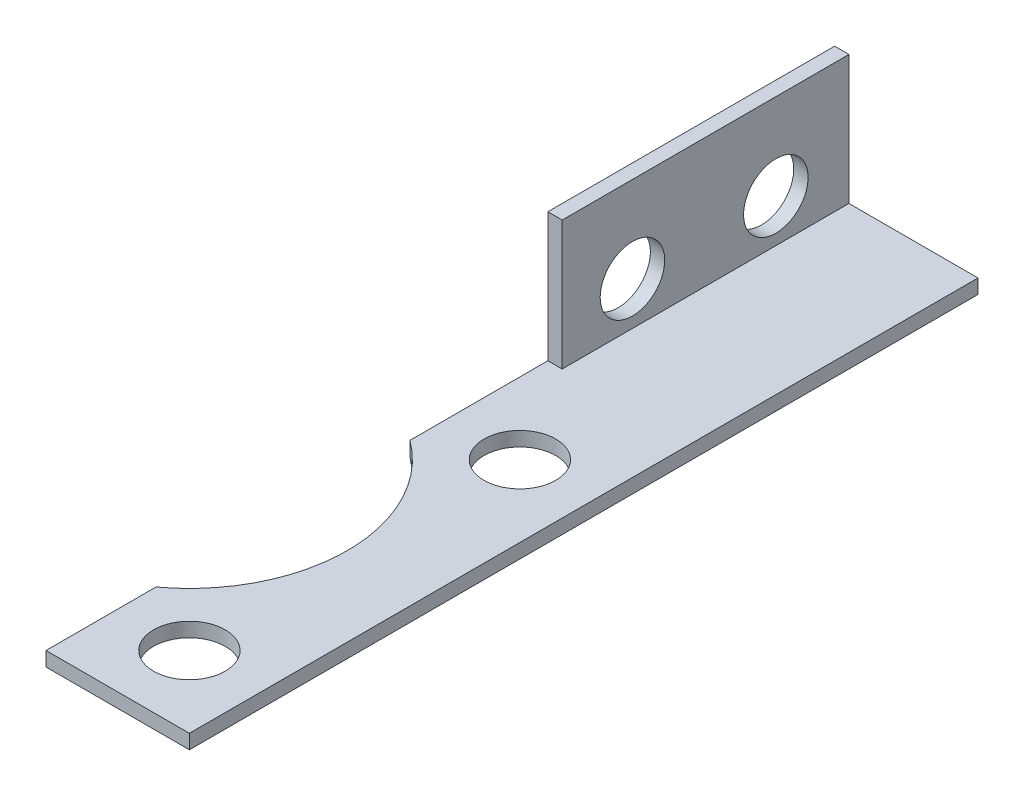
ISO-10303-21;
HEADER;
FILE_DESCRIPTION(('STEP AP214'),'2;1');
FILE_NAME('part.step','',(''),(''),'','','');
FILE_SCHEMA(('AUTOMOTIVE_DESIGN { 1 0 10303 214 1 1 1 1 }'));
ENDSEC;
DATA;
#1=APPLICATION_CONTEXT('core data for automotive mechanical design processes');
#2=APPLICATION_PROTOCOL_DEFINITION('international standard','automotive_design',2000,#1);
#3=PRODUCT_CONTEXT('',#1,'mechanical');
#4=PRODUCT('Part','Part','',(#3));
#5=PRODUCT_RELATED_PRODUCT_CATEGORY('part','',(#4));
#6=PRODUCT_DEFINITION_FORMATION('','',#4);
#7=PRODUCT_DEFINITION_CONTEXT('part definition',#1,'design');
#8=PRODUCT_DEFINITION('design','',#6,#7);
#9=PRODUCT_DEFINITION_SHAPE('','',#8);
#10=(LENGTH_UNIT() NAMED_UNIT(*) SI_UNIT(.MILLI.,.METRE.));
#11=(NAMED_UNIT(*) PLANE_ANGLE_UNIT() SI_UNIT($,.RADIAN.));
#12=(NAMED_UNIT(*) SI_UNIT($,.STERADIAN.) SOLID_ANGLE_UNIT());
#13=UNCERTAINTY_MEASURE_WITH_UNIT(LENGTH_MEASURE(1.E-05),#10,'distance_accuracy_value','');
#14=(GEOMETRIC_REPRESENTATION_CONTEXT(3) GLOBAL_UNCERTAINTY_ASSIGNED_CONTEXT((#13)) GLOBAL_UNIT_ASSIGNED_CONTEXT((#10,
#11,#12)) REPRESENTATION_CONTEXT('',''));
#15=CARTESIAN_POINT('',(0.,0.,0.));
#16=DIRECTION('',(0.,0.,1.));
#17=DIRECTION('',(1.,0.,0.));
#18=AXIS2_PLACEMENT_3D('',#15,#16,#17);
#19=CARTESIAN_POINT('',(1.,10.,55.));
#20=DIRECTION('',(0.,-1.,0.));
#21=DIRECTION('',(0.,0.,-1.));
#22=AXIS2_PLACEMENT_3D('',#19,#20,#21);
#23=PLANE('',#22);
#24=DIRECTION('',(-1.,0.,0.));
#25=VECTOR('',#24,1.);
#26=CARTESIAN_POINT('',(0.,10.,20.));
#27=LINE('',#26,#25);
#28=CARTESIAN_POINT('',(0.999999999999999,10.,20.));
#29=VERTEX_POINT('',#28);
#30=CARTESIAN_POINT('',(0.,10.,20.));
#31=VERTEX_POINT('',#30);
#32=EDGE_CURVE('E130',#29,#31,#27,.T.);
#33=ORIENTED_EDGE('',*,*,#32,.F.);
#34=DIRECTION('',(0.,0.,-1.));
#35=VECTOR('',#34,1.);
#36=CARTESIAN_POINT('',(1.,10.,55.));
#37=LINE('',#36,#35);
#38=CARTESIAN_POINT('',(1.,10.,0.));
#39=VERTEX_POINT('',#38);
#40=EDGE_CURVE('E87',#29,#39,#37,.T.);
#41=ORIENTED_EDGE('',*,*,#40,.T.);
#42=DIRECTION('',(-1.,0.,0.));
#43=VECTOR('',#42,1.);
#44=CARTESIAN_POINT('',(1.,10.,0.));
#45=LINE('',#44,#43);
#46=CARTESIAN_POINT('',(0.,10.,0.));
#47=VERTEX_POINT('',#46);
#48=EDGE_CURVE('E163',#39,#47,#45,.T.);
#49=ORIENTED_EDGE('',*,*,#48,.T.);
#50=DIRECTION('',(0.,0.,-1.));
#51=VECTOR('',#50,1.);
#52=CARTESIAN_POINT('',(0.,10.,55.));
#53=LINE('',#52,#51);
#54=EDGE_CURVE('E11',#31,#47,#53,.T.);
#55=ORIENTED_EDGE('',*,*,#54,.F.);
#56=EDGE_LOOP('',(#33,#41,#49,#55));
#57=FACE_BOUND('',#56,.T.);
#58=ADVANCED_FACE('F38',(#57),#23,.F.);
#59=CARTESIAN_POINT('',(0.,10.,55.));
#60=DIRECTION('',(1.,0.,0.));
#61=DIRECTION('',(0.,0.,-1.));
#62=AXIS2_PLACEMENT_3D('',#59,#60,#61);
#63=PLANE('',#62);
#64=DIRECTION('',(0.,-1.,0.));
#65=VECTOR('',#64,1.);
#66=CARTESIAN_POINT('',(0.,10.,55.));
#67=LINE('',#66,#65);
#68=CARTESIAN_POINT('',(0.,0.999999999999999,55.));
#69=VERTEX_POINT('',#68);
#70=CARTESIAN_POINT('',(0.,0.,55.));
#71=VERTEX_POINT('',#70);
#72=EDGE_CURVE('E91',#69,#71,#67,.T.);
#73=ORIENTED_EDGE('',*,*,#72,.F.);
#74=DIRECTION('',(0.,0.,1.));
#75=VECTOR('',#74,1.);
#76=CARTESIAN_POINT('',(0.,0.999999999999999,20.));
#77=LINE('',#76,#75);
#78=CARTESIAN_POINT('',(0.,0.999999999999999,47.3307537793234));
#79=VERTEX_POINT('',#78);
#80=EDGE_CURVE('E138',#79,#69,#77,.T.);
#81=ORIENTED_EDGE('',*,*,#80,.F.);
#82=DIRECTION('',(0.,1.,0.));
#83=VECTOR('',#82,1.);
#84=CARTESIAN_POINT('',(0.,0.,47.3307537793234));
#85=LINE('',#84,#83);
#86=CARTESIAN_POINT('',(0.,0.,47.3307537793234));
#87=VERTEX_POINT('',#86);
#88=EDGE_CURVE('E157',#79,#87,#85,.F.);
#89=ORIENTED_EDGE('',*,*,#88,.T.);
#90=DIRECTION('',(0.,0.,-1.));
#91=VECTOR('',#90,1.);
#92=CARTESIAN_POINT('',(0.,0.,55.));
#93=LINE('',#92,#91);
#94=EDGE_CURVE('E45',#71,#87,#93,.T.);
#95=ORIENTED_EDGE('',*,*,#94,.F.);
#96=EDGE_LOOP('',(#73,#81,#89,#95));
#97=FACE_BOUND('',#96,.T.);
#98=ADVANCED_FACE('F220',(#97),#63,.F.);
#99=CARTESIAN_POINT('',(0.999999999999999,0.999999999999999,55.));
#100=DIRECTION('',(-1.,0.,0.));
#101=DIRECTION('',(0.,-1.,0.));
#102=AXIS2_PLACEMENT_3D('',#99,#100,#101);
#103=PLANE('',#102);
#104=CARTESIAN_POINT('',(0.999999999999999,4.,5.1));
#105=DIRECTION('',(-1.,0.,0.));
#106=DIRECTION('',(0.,-1.,0.));
#107=AXIS2_PLACEMENT_3D('',#104,#105,#106);
#108=CIRCLE('',#107,2.25);
#109=CARTESIAN_POINT('',(0.999999999999999,1.75,5.1));
#110=VERTEX_POINT('',#109);
#111=EDGE_CURVE('E133',#110,#110,#108,.T.);
#112=ORIENTED_EDGE('',*,*,#111,.T.);
#113=EDGE_LOOP('',(#112));
#114=FACE_BOUND('',#113,.T.);
#115=CARTESIAN_POINT('',(0.999999999999999,4.,15.1));
#116=DIRECTION('',(-1.,0.,0.));
#117=DIRECTION('',(0.,-1.,0.));
#118=AXIS2_PLACEMENT_3D('',#115,#116,#117);
#119=CIRCLE('',#118,2.25);
#120=CARTESIAN_POINT('',(0.999999999999999,1.75,15.1));
#121=VERTEX_POINT('',#120);
#122=EDGE_CURVE('E230',#121,#121,#119,.T.);
#123=ORIENTED_EDGE('',*,*,#122,.T.);
#124=EDGE_LOOP('',(#123));
#125=FACE_BOUND('',#124,.T.);
#126=DIRECTION('',(0.,1.,0.));
#127=VECTOR('',#126,1.);
#128=CARTESIAN_POINT('',(0.999999999999999,10.,20.));
#129=LINE('',#128,#127);
#130=CARTESIAN_POINT('',(0.999999999999999,0.999999999999999,20.));
#131=VERTEX_POINT('',#130);
#132=EDGE_CURVE('E125',#131,#29,#129,.T.);
#133=ORIENTED_EDGE('',*,*,#132,.F.);
#134=DIRECTION('',(0.,0.,-1.));
#135=VECTOR('',#134,1.);
#136=CARTESIAN_POINT('',(0.999999999999999,0.999999999999999,55.));
#137=LINE('',#136,#135);
#138=CARTESIAN_POINT('',(0.999999999999999,0.999999999999999,0.));
#139=VERTEX_POINT('',#138);
#140=EDGE_CURVE('E122',#131,#139,#137,.T.);
#141=ORIENTED_EDGE('',*,*,#140,.T.);
#142=DIRECTION('',(0.,1.,0.));
#143=VECTOR('',#142,1.);
#144=CARTESIAN_POINT('',(0.999999999999999,0.999999999999999,0.));
#145=LINE('',#144,#143);
#146=EDGE_CURVE('E166',#139,#39,#145,.T.);
#147=ORIENTED_EDGE('',*,*,#146,.T.);
#148=ORIENTED_EDGE('',*,*,#40,.F.);
#149=EDGE_LOOP('',(#133,#141,#147,#148));
#150=FACE_BOUND('',#149,.T.);
#151=ADVANCED_FACE('F224',(#114,#125,#150),#103,.F.);
#152=CARTESIAN_POINT('',(0.,4.,5.1));
#153=DIRECTION('',(-1.,0.,0.));
#154=DIRECTION('',(0.,0.,1.));
#155=AXIS2_PLACEMENT_3D('',#152,#153,#154);
#156=CIRCLE('',#155,2.25);
#157=CARTESIAN_POINT('',(0.,4.,7.35));
#158=VERTEX_POINT('',#157);
#159=EDGE_CURVE('E233',#158,#158,#156,.T.);
#160=ORIENTED_EDGE('',*,*,#159,.F.);
#161=EDGE_LOOP('',(#160));
#162=FACE_BOUND('',#161,.T.);
#163=CARTESIAN_POINT('',(0.,4.,15.1));
#164=DIRECTION('',(-1.,0.,0.));
#165=DIRECTION('',(0.,0.,1.));
#166=AXIS2_PLACEMENT_3D('',#163,#164,#165);
#167=CIRCLE('',#166,2.25);
#168=CARTESIAN_POINT('',(0.,4.,17.35));
#169=VERTEX_POINT('',#168);
#170=EDGE_CURVE('E234',#169,#169,#167,.T.);
#171=ORIENTED_EDGE('',*,*,#170,.F.);
#172=EDGE_LOOP('',(#171));
#173=FACE_BOUND('',#172,.T.);
#174=DIRECTION('',(0.,1.,0.));
#175=VECTOR('',#174,1.);
#176=CARTESIAN_POINT('',(0.,0.,29.6192462206766));
#177=LINE('',#176,#175);
#178=CARTESIAN_POINT('',(0.,0.,29.6192462206766));
#179=VERTEX_POINT('',#178);
#180=CARTESIAN_POINT('',(0.,0.999999999999999,29.6192462206766));
#181=VERTEX_POINT('',#180);
#182=EDGE_CURVE('E52',#179,#181,#177,.T.);
#183=ORIENTED_EDGE('',*,*,#182,.T.);
#184=CARTESIAN_POINT('',(0.,0.999999999999999,20.));
#185=VERTEX_POINT('',#184);
#186=EDGE_CURVE('E120',#185,#181,#77,.T.);
#187=ORIENTED_EDGE('',*,*,#186,.F.);
#188=DIRECTION('',(0.,-1.,0.));
#189=VECTOR('',#188,1.);
#190=CARTESIAN_POINT('',(0.,10.,20.));
#191=LINE('',#190,#189);
#192=EDGE_CURVE('E126',#31,#185,#191,.T.);
#193=ORIENTED_EDGE('',*,*,#192,.F.);
#194=ORIENTED_EDGE('',*,*,#54,.T.);
#195=DIRECTION('',(0.,-1.,0.));
#196=VECTOR('',#195,1.);
#197=CARTESIAN_POINT('',(0.,10.,0.));
#198=LINE('',#197,#196);
#199=CARTESIAN_POINT('',(0.,0.,0.));
#200=VERTEX_POINT('',#199);
#201=EDGE_CURVE('E172',#47,#200,#198,.T.);
#202=ORIENTED_EDGE('',*,*,#201,.T.);
#203=EDGE_CURVE('E189',#179,#200,#93,.T.);
#204=ORIENTED_EDGE('',*,*,#203,.F.);
#205=EDGE_LOOP('',(#183,#187,#193,#194,#202,#204));
#206=FACE_BOUND('',#205,.T.);
#207=ADVANCED_FACE('F135',(#162,#173,#206),#63,.F.);
#208=CARTESIAN_POINT('',(0.,0.,55.));
#209=DIRECTION('',(0.,1.,0.));
#210=DIRECTION('',(0.,0.,1.));
#211=AXIS2_PLACEMENT_3D('',#208,#209,#210);
#212=PLANE('',#211);
#213=CARTESIAN_POINT('',(5.,0.,26.95));
#214=DIRECTION('',(0.,1.,0.));
#215=DIRECTION('',(-1.,0.,0.));
#216=AXIS2_PLACEMENT_3D('',#213,#214,#215);
#217=CIRCLE('',#216,2.5);
#218=CARTESIAN_POINT('',(2.5,0.,26.95));
#219=VERTEX_POINT('',#218);
#220=EDGE_CURVE('E148',#219,#219,#217,.T.);
#221=ORIENTED_EDGE('',*,*,#220,.T.);
#222=EDGE_LOOP('',(#221));
#223=FACE_BOUND('',#222,.T.);
#224=CARTESIAN_POINT('',(5.,0.,50.));
#225=DIRECTION('',(0.,1.,0.));
#226=DIRECTION('',(-1.,0.,0.));
#227=AXIS2_PLACEMENT_3D('',#224,#225,#226);
#228=CIRCLE('',#227,2.5);
#229=CARTESIAN_POINT('',(2.5,0.,50.));
#230=VERTEX_POINT('',#229);
#231=EDGE_CURVE('E154',#230,#230,#228,.T.);
#232=ORIENTED_EDGE('',*,*,#231,.T.);
#233=EDGE_LOOP('',(#232));
#234=FACE_BOUND('',#233,.T.);
#235=ORIENTED_EDGE('',*,*,#94,.T.);
#236=CARTESIAN_POINT('',(-6.525,0.,38.475));
#237=DIRECTION('',(0.,1.,0.));
#238=DIRECTION('',(1.,0.,0.));
#239=AXIS2_PLACEMENT_3D('',#236,#237,#238);
#240=CIRCLE('',#239,11.);
#241=EDGE_CURVE('E140',#87,#179,#240,.T.);
#242=ORIENTED_EDGE('',*,*,#241,.T.);
#243=ORIENTED_EDGE('',*,*,#203,.T.);
#244=DIRECTION('',(1.,0.,0.));
#245=VECTOR('',#244,1.);
#246=CARTESIAN_POINT('',(0.,0.,0.));
#247=LINE('',#246,#245);
#248=CARTESIAN_POINT('',(10.,0.,0.));
#249=VERTEX_POINT('',#248);
#250=EDGE_CURVE('E175',#200,#249,#247,.T.);
#251=ORIENTED_EDGE('',*,*,#250,.T.);
#252=DIRECTION('',(0.,0.,-1.));
#253=VECTOR('',#252,1.);
#254=CARTESIAN_POINT('',(10.,0.,55.));
#255=LINE('',#254,#253);
#256=CARTESIAN_POINT('',(10.,0.,55.));
#257=VERTEX_POINT('',#256);
#258=EDGE_CURVE('E187',#257,#249,#255,.T.);
#259=ORIENTED_EDGE('',*,*,#258,.F.);
#260=DIRECTION('',(1.,0.,0.));
#261=VECTOR('',#260,1.);
#262=CARTESIAN_POINT('',(0.,0.,55.));
#263=LINE('',#262,#261);
#264=EDGE_CURVE('E165',#71,#257,#263,.T.);
#265=ORIENTED_EDGE('',*,*,#264,.F.);
#266=EDGE_LOOP('',(#235,#242,#243,#251,#259,#265));
#267=FACE_BOUND('',#266,.T.);
#268=ADVANCED_FACE('F193',(#223,#234,#267),#212,.F.);
#269=CARTESIAN_POINT('',(10.,0.,55.));
#270=DIRECTION('',(-1.,0.,0.));
#271=DIRECTION('',(0.,0.,1.));
#272=AXIS2_PLACEMENT_3D('',#269,#270,#271);
#273=PLANE('',#272);
#274=DIRECTION('',(0.,1.,0.));
#275=VECTOR('',#274,1.);
#276=CARTESIAN_POINT('',(10.,0.,0.));
#277=LINE('',#276,#275);
#278=CARTESIAN_POINT('',(10.,1.,0.));
#279=VERTEX_POINT('',#278);
#280=EDGE_CURVE('E177',#249,#279,#277,.T.);
#281=ORIENTED_EDGE('',*,*,#280,.T.);
#282=DIRECTION('',(0.,0.,-1.));
#283=VECTOR('',#282,1.);
#284=CARTESIAN_POINT('',(10.,1.,55.));
#285=LINE('',#284,#283);
#286=CARTESIAN_POINT('',(10.,1.,55.));
#287=VERTEX_POINT('',#286);
#288=EDGE_CURVE('E184',#287,#279,#285,.T.);
#289=ORIENTED_EDGE('',*,*,#288,.F.);
#290=DIRECTION('',(0.,1.,0.));
#291=VECTOR('',#290,1.);
#292=CARTESIAN_POINT('',(10.,0.,55.));
#293=LINE('',#292,#291);
#294=EDGE_CURVE('E61',#257,#287,#293,.T.);
#295=ORIENTED_EDGE('',*,*,#294,.F.);
#296=ORIENTED_EDGE('',*,*,#258,.T.);
#297=EDGE_LOOP('',(#281,#289,#295,#296));
#298=FACE_BOUND('',#297,.T.);
#299=ADVANCED_FACE('F204',(#298),#273,.F.);
#300=CARTESIAN_POINT('',(10.,1.,55.));
#301=DIRECTION('',(0.,-1.,0.));
#302=DIRECTION('',(1.,0.,0.));
#303=AXIS2_PLACEMENT_3D('',#300,#301,#302);
#304=PLANE('',#303);
#305=CARTESIAN_POINT('',(5.,0.999999999999999,26.95));
#306=DIRECTION('',(0.,1.,0.));
#307=DIRECTION('',(-1.,0.,0.));
#308=AXIS2_PLACEMENT_3D('',#305,#306,#307);
#309=CIRCLE('',#308,2.5);
#310=CARTESIAN_POINT('',(2.5,0.999999999999999,26.95));
#311=VERTEX_POINT('',#310);
#312=EDGE_CURVE('E146',#311,#311,#309,.T.);
#313=ORIENTED_EDGE('',*,*,#312,.F.);
#314=EDGE_LOOP('',(#313));
#315=FACE_BOUND('',#314,.T.);
#316=CARTESIAN_POINT('',(5.,0.999999999999999,50.));
#317=DIRECTION('',(0.,1.,0.));
#318=DIRECTION('',(-1.,0.,0.));
#319=AXIS2_PLACEMENT_3D('',#316,#317,#318);
#320=CIRCLE('',#319,2.5);
#321=CARTESIAN_POINT('',(2.5,0.999999999999999,50.));
#322=VERTEX_POINT('',#321);
#323=EDGE_CURVE('E151',#322,#322,#320,.T.);
#324=ORIENTED_EDGE('',*,*,#323,.F.);
#325=EDGE_LOOP('',(#324));
#326=FACE_BOUND('',#325,.T.);
#327=ORIENTED_EDGE('',*,*,#140,.F.);
#328=DIRECTION('',(1.,0.,0.));
#329=VECTOR('',#328,1.);
#330=CARTESIAN_POINT('',(0.,0.999999999999999,20.));
#331=LINE('',#330,#329);
#332=EDGE_CURVE('E116',#185,#131,#331,.T.);
#333=ORIENTED_EDGE('',*,*,#332,.F.);
#334=ORIENTED_EDGE('',*,*,#186,.T.);
#335=CARTESIAN_POINT('',(-6.525,0.999999999999998,38.475));
#336=DIRECTION('',(0.,1.,0.));
#337=DIRECTION('',(1.,0.,0.));
#338=AXIS2_PLACEMENT_3D('',#335,#336,#337);
#339=CIRCLE('',#338,11.);
#340=EDGE_CURVE('E137',#79,#181,#339,.T.);
#341=ORIENTED_EDGE('',*,*,#340,.F.);
#342=ORIENTED_EDGE('',*,*,#80,.T.);
#343=DIRECTION('',(-1.,0.,0.));
#344=VECTOR('',#343,1.);
#345=CARTESIAN_POINT('',(10.,1.,55.));
#346=LINE('',#345,#344);
#347=EDGE_CURVE('E169',#287,#69,#346,.T.);
#348=ORIENTED_EDGE('',*,*,#347,.F.);
#349=ORIENTED_EDGE('',*,*,#288,.T.);
#350=DIRECTION('',(-1.,0.,0.));
#351=VECTOR('',#350,1.);
#352=CARTESIAN_POINT('',(10.,1.,0.));
#353=LINE('',#352,#351);
#354=EDGE_CURVE('E179',#279,#139,#353,.T.);
#355=ORIENTED_EDGE('',*,*,#354,.T.);
#356=EDGE_LOOP('',(#327,#333,#334,#341,#342,#348,#349,#355));
#357=FACE_BOUND('',#356,.T.);
#358=ADVANCED_FACE('F118',(#315,#326,#357),#304,.F.);
#359=CARTESIAN_POINT('',(0.,0.,55.));
#360=DIRECTION('',(0.,0.,1.));
#361=DIRECTION('',(1.,0.,0.));
#362=AXIS2_PLACEMENT_3D('',#359,#360,#361);
#363=PLANE('',#362);
#364=ORIENTED_EDGE('',*,*,#347,.T.);
#365=ORIENTED_EDGE('',*,*,#72,.T.);
#366=ORIENTED_EDGE('',*,*,#264,.T.);
#367=ORIENTED_EDGE('',*,*,#294,.T.);
#368=EDGE_LOOP('',(#364,#365,#366,#367));
#369=FACE_BOUND('',#368,.T.);
#370=ADVANCED_FACE('F207',(#369),#363,.T.);
#371=CARTESIAN_POINT('',(0.,0.,0.));
#372=DIRECTION('',(0.,0.,1.));
#373=DIRECTION('',(1.,0.,0.));
#374=AXIS2_PLACEMENT_3D('',#371,#372,#373);
#375=PLANE('',#374);
#376=ORIENTED_EDGE('',*,*,#48,.F.);
#377=ORIENTED_EDGE('',*,*,#146,.F.);
#378=ORIENTED_EDGE('',*,*,#354,.F.);
#379=ORIENTED_EDGE('',*,*,#280,.F.);
#380=ORIENTED_EDGE('',*,*,#250,.F.);
#381=ORIENTED_EDGE('',*,*,#201,.F.);
#382=EDGE_LOOP('',(#376,#377,#378,#379,#380,#381));
#383=FACE_BOUND('',#382,.T.);
#384=ADVANCED_FACE('F200',(#383),#375,.F.);
#385=CARTESIAN_POINT('',(-6.525,0.,38.475));
#386=DIRECTION('',(0.,1.,0.));
#387=DIRECTION('',(-1.,0.,0.));
#388=AXIS2_PLACEMENT_3D('',#385,#386,#387);
#389=CYLINDRICAL_SURFACE('',#388,11.);
#390=ORIENTED_EDGE('',*,*,#241,.F.);
#391=ORIENTED_EDGE('',*,*,#88,.F.);
#392=ORIENTED_EDGE('',*,*,#340,.T.);
#393=ORIENTED_EDGE('',*,*,#182,.F.);
#394=EDGE_LOOP('',(#390,#391,#392,#393));
#395=FACE_BOUND('',#394,.T.);
#396=ADVANCED_FACE('F214',(#395),#389,.F.);
#397=CARTESIAN_POINT('',(5.,0.,50.));
#398=DIRECTION('',(0.,1.,0.));
#399=DIRECTION('',(-1.,0.,0.));
#400=AXIS2_PLACEMENT_3D('',#397,#398,#399);
#401=CYLINDRICAL_SURFACE('',#400,2.5);
#402=ORIENTED_EDGE('',*,*,#231,.F.);
#403=EDGE_LOOP('',(#402));
#404=FACE_BOUND('',#403,.T.);
#405=ORIENTED_EDGE('',*,*,#323,.T.);
#406=EDGE_LOOP('',(#405));
#407=FACE_BOUND('',#406,.T.);
#408=ADVANCED_FACE('F269',(#404,#407),#401,.F.);
#409=CARTESIAN_POINT('',(5.,0.,26.95));
#410=DIRECTION('',(0.,1.,0.));
#411=DIRECTION('',(-1.,0.,0.));
#412=AXIS2_PLACEMENT_3D('',#409,#410,#411);
#413=CYLINDRICAL_SURFACE('',#412,2.5);
#414=ORIENTED_EDGE('',*,*,#220,.F.);
#415=EDGE_LOOP('',(#414));
#416=FACE_BOUND('',#415,.T.);
#417=ORIENTED_EDGE('',*,*,#312,.T.);
#418=EDGE_LOOP('',(#417));
#419=FACE_BOUND('',#418,.T.);
#420=ADVANCED_FACE('F272',(#416,#419),#413,.F.);
#421=CARTESIAN_POINT('',(0.,0.,20.));
#422=DIRECTION('',(0.,0.,1.));
#423=DIRECTION('',(1.,0.,0.));
#424=AXIS2_PLACEMENT_3D('',#421,#422,#423);
#425=PLANE('',#424);
#426=ORIENTED_EDGE('',*,*,#192,.T.);
#427=ORIENTED_EDGE('',*,*,#332,.T.);
#428=ORIENTED_EDGE('',*,*,#132,.T.);
#429=ORIENTED_EDGE('',*,*,#32,.T.);
#430=EDGE_LOOP('',(#426,#427,#428,#429));
#431=FACE_BOUND('',#430,.T.);
#432=ADVANCED_FACE('F129',(#431),#425,.T.);
#433=CARTESIAN_POINT('',(10.,4.,15.1));
#434=DIRECTION('',(-1.,0.,0.));
#435=DIRECTION('',(0.,0.,1.));
#436=AXIS2_PLACEMENT_3D('',#433,#434,#435);
#437=CYLINDRICAL_SURFACE('',#436,2.25);
#438=ORIENTED_EDGE('',*,*,#170,.T.);
#439=EDGE_LOOP('',(#438));
#440=FACE_BOUND('',#439,.T.);
#441=ORIENTED_EDGE('',*,*,#122,.F.);
#442=EDGE_LOOP('',(#441));
#443=FACE_BOUND('',#442,.T.);
#444=ADVANCED_FACE('F247',(#440,#443),#437,.F.);
#445=CARTESIAN_POINT('',(10.,4.,5.1));
#446=DIRECTION('',(-1.,0.,0.));
#447=DIRECTION('',(0.,0.,1.));
#448=AXIS2_PLACEMENT_3D('',#445,#446,#447);
#449=CYLINDRICAL_SURFACE('',#448,2.25);
#450=ORIENTED_EDGE('',*,*,#159,.T.);
#451=EDGE_LOOP('',(#450));
#452=FACE_BOUND('',#451,.T.);
#453=ORIENTED_EDGE('',*,*,#111,.F.);
#454=EDGE_LOOP('',(#453));
#455=FACE_BOUND('',#454,.T.);
#456=ADVANCED_FACE('F240',(#452,#455),#449,.F.);
#457=CLOSED_SHELL('',(#58,#98,#151,#207,#268,#299,#358,#370,#384,#396,#408,#420,#432,#444,#456));
#458=MANIFOLD_SOLID_BREP('B2',#457);
#459=ADVANCED_BREP_SHAPE_REPRESENTATION('',(#18,#458),#14);
#460=SHAPE_DEFINITION_REPRESENTATION(#9,#459);
ENDSEC;
END-ISO-10303-21;
